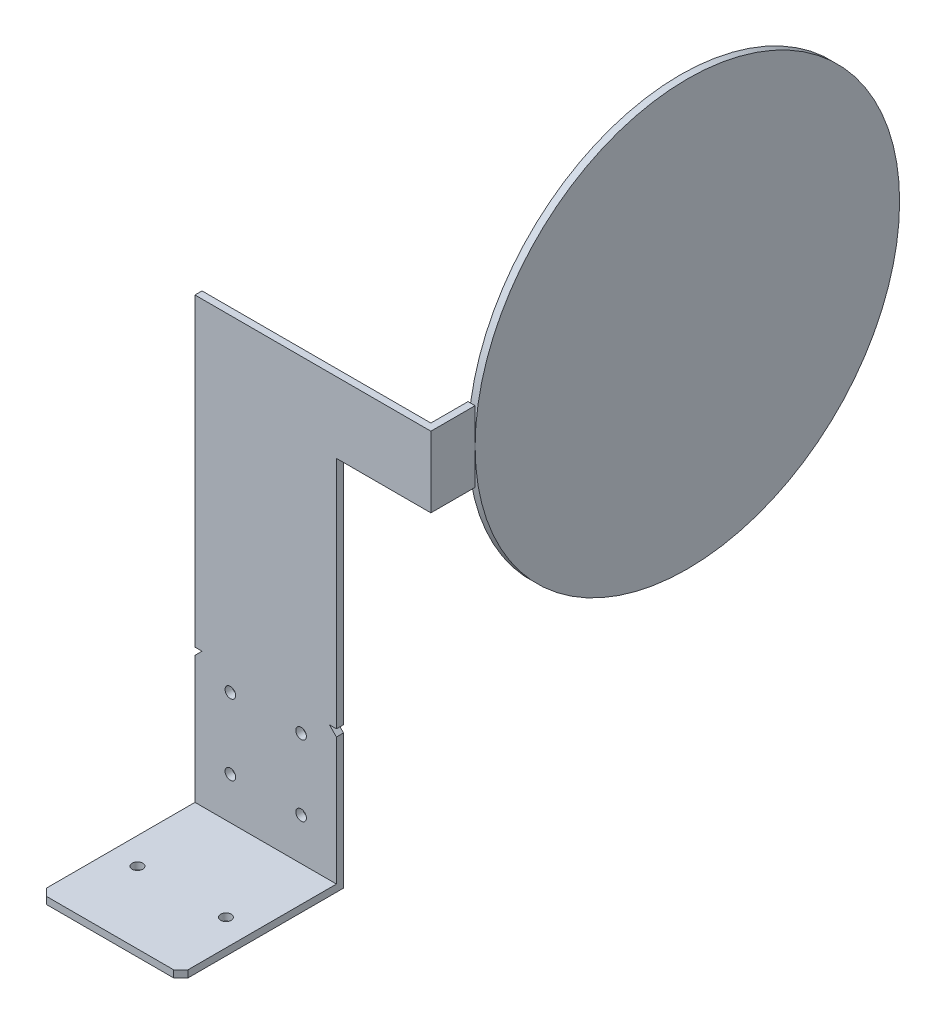
ISO-10303-21;
HEADER;
FILE_DESCRIPTION(('STEP AP214'),'2;1');
FILE_NAME('part.step','',(''),(''),'','','');
FILE_SCHEMA(('AUTOMOTIVE_DESIGN { 1 0 10303 214 1 1 1 1 }'));
ENDSEC;
DATA;
#1=APPLICATION_CONTEXT('core data for automotive mechanical design processes');
#2=APPLICATION_PROTOCOL_DEFINITION('international standard','automotive_design',2000,#1);
#3=PRODUCT_CONTEXT('',#1,'mechanical');
#4=PRODUCT('Part','Part','',(#3));
#5=PRODUCT_RELATED_PRODUCT_CATEGORY('part','',(#4));
#6=PRODUCT_DEFINITION_FORMATION('','',#4);
#7=PRODUCT_DEFINITION_CONTEXT('part definition',#1,'design');
#8=PRODUCT_DEFINITION('design','',#6,#7);
#9=PRODUCT_DEFINITION_SHAPE('','',#8);
#10=(LENGTH_UNIT() NAMED_UNIT(*) SI_UNIT(.MILLI.,.METRE.));
#11=(NAMED_UNIT(*) PLANE_ANGLE_UNIT() SI_UNIT($,.RADIAN.));
#12=(NAMED_UNIT(*) SI_UNIT($,.STERADIAN.) SOLID_ANGLE_UNIT());
#13=UNCERTAINTY_MEASURE_WITH_UNIT(LENGTH_MEASURE(1.E-05),#10,'distance_accuracy_value','');
#14=(GEOMETRIC_REPRESENTATION_CONTEXT(3) GLOBAL_UNCERTAINTY_ASSIGNED_CONTEXT((#13)) GLOBAL_UNIT_ASSIGNED_CONTEXT((#10,
#11,#12)) REPRESENTATION_CONTEXT('',''));
#15=CARTESIAN_POINT('',(0.,0.,0.));
#16=DIRECTION('',(0.,0.,1.));
#17=DIRECTION('',(1.,0.,0.));
#18=AXIS2_PLACEMENT_3D('',#15,#16,#17);
#19=CARTESIAN_POINT('',(64.69,114.21,-72.5));
#20=DIRECTION('',(1.,0.,0.));
#21=DIRECTION('',(0.,0.,-1.));
#22=AXIS2_PLACEMENT_3D('',#19,#20,#21);
#23=CYLINDRICAL_SURFACE('',#22,60.);
#24=CARTESIAN_POINT('',(64.69,114.21,-72.5));
#25=DIRECTION('',(1.,0.,0.));
#26=DIRECTION('',(0.,0.,-1.));
#27=AXIS2_PLACEMENT_3D('',#24,#25,#26);
#28=CIRCLE('',#27,60.);
#29=CARTESIAN_POINT('',(64.69,114.21,-132.5));
#30=VERTEX_POINT('',#29);
#31=EDGE_CURVE('E11',#30,#30,#28,.T.);
#32=ORIENTED_EDGE('',*,*,#31,.T.);
#33=EDGE_LOOP('',(#32));
#34=FACE_BOUND('',#33,.T.);
#35=CARTESIAN_POINT('',(66.69,114.21,-72.5));
#36=DIRECTION('',(1.,0.,0.));
#37=DIRECTION('',(0.,0.,-1.));
#38=AXIS2_PLACEMENT_3D('',#35,#36,#37);
#39=CIRCLE('',#38,60.);
#40=CARTESIAN_POINT('',(66.69,114.21,-132.5));
#41=VERTEX_POINT('',#40);
#42=EDGE_CURVE('E46',#41,#41,#39,.T.);
#43=ORIENTED_EDGE('',*,*,#42,.F.);
#44=EDGE_LOOP('',(#43));
#45=FACE_BOUND('',#44,.T.);
#46=ADVANCED_FACE('F43',(#34,#45),#23,.T.);
#47=CARTESIAN_POINT('',(64.69,114.21,-72.5));
#48=DIRECTION('',(1.,0.,0.));
#49=DIRECTION('',(0.,0.,-1.));
#50=AXIS2_PLACEMENT_3D('',#47,#48,#49);
#51=PLANE('',#50);
#52=ORIENTED_EDGE('',*,*,#31,.F.);
#53=EDGE_LOOP('',(#52));
#54=FACE_BOUND('',#53,.T.);
#55=ADVANCED_FACE('F58',(#54),#51,.F.);
#56=CARTESIAN_POINT('',(66.69,114.21,-72.5));
#57=DIRECTION('',(1.,0.,0.));
#58=DIRECTION('',(0.,0.,-1.));
#59=AXIS2_PLACEMENT_3D('',#56,#57,#58);
#60=PLANE('',#59);
#61=ORIENTED_EDGE('',*,*,#42,.T.);
#62=EDGE_LOOP('',(#61));
#63=FACE_BOUND('',#62,.T.);
#64=ADVANCED_FACE('F55',(#63),#60,.T.);
#65=CLOSED_SHELL('',(#46,#55,#64));
#66=MANIFOLD_SOLID_BREP('B2',#65);
#67=CARTESIAN_POINT('',(40.,0.,44.));
#68=DIRECTION('',(0.,-1.,0.));
#69=DIRECTION('',(0.,0.,-1.));
#70=AXIS2_PLACEMENT_3D('',#67,#68,#69);
#71=PLANE('',#70);
#72=CARTESIAN_POINT('',(7.5,0.,23.75));
#73=DIRECTION('',(0.,-1.,0.));
#74=DIRECTION('',(0.,0.,-1.));
#75=AXIS2_PLACEMENT_3D('',#72,#73,#74);
#76=CIRCLE('',#75,1.49999999997635);
#77=CARTESIAN_POINT('',(7.5,0.,22.2500000000236));
#78=VERTEX_POINT('',#77);
#79=EDGE_CURVE('E305',#78,#78,#76,.F.);
#80=ORIENTED_EDGE('',*,*,#79,.F.);
#81=EDGE_LOOP('',(#80));
#82=FACE_BOUND('',#81,.T.);
#83=CARTESIAN_POINT('',(32.5,0.,23.75));
#84=DIRECTION('',(0.,-1.,0.));
#85=DIRECTION('',(0.,0.,-1.));
#86=AXIS2_PLACEMENT_3D('',#83,#84,#85);
#87=CIRCLE('',#86,1.49999999997635);
#88=CARTESIAN_POINT('',(32.5,0.,22.2500000000236));
#89=VERTEX_POINT('',#88);
#90=EDGE_CURVE('E311',#89,#89,#87,.F.);
#91=ORIENTED_EDGE('',*,*,#90,.F.);
#92=EDGE_LOOP('',(#91));
#93=FACE_BOUND('',#92,.T.);
#94=DIRECTION('',(-1.,0.,0.));
#95=VECTOR('',#94,1.);
#96=CARTESIAN_POINT('',(40.,0.,44.));
#97=LINE('',#96,#95);
#98=CARTESIAN_POINT('',(38.,0.,44.));
#99=VERTEX_POINT('',#98);
#100=CARTESIAN_POINT('',(2.00000000000001,0.,44.));
#101=VERTEX_POINT('',#100);
#102=EDGE_CURVE('E342',#99,#101,#97,.T.);
#103=ORIENTED_EDGE('',*,*,#102,.F.);
#104=DIRECTION('',(0.707106781186549,0.,-0.707106781186546));
#105=VECTOR('',#104,1.);
#106=CARTESIAN_POINT('',(40.,0.,42.));
#107=LINE('',#106,#105);
#108=CARTESIAN_POINT('',(40.,0.,42.));
#109=VERTEX_POINT('',#108);
#110=EDGE_CURVE('E362',#99,#109,#107,.T.);
#111=ORIENTED_EDGE('',*,*,#110,.T.);
#112=DIRECTION('',(0.,0.,1.));
#113=VECTOR('',#112,1.);
#114=CARTESIAN_POINT('',(40.,0.,44.));
#115=LINE('',#114,#113);
#116=CARTESIAN_POINT('',(40.,0.,0.));
#117=VERTEX_POINT('',#116);
#118=EDGE_CURVE('E315',#117,#109,#115,.T.);
#119=ORIENTED_EDGE('',*,*,#118,.F.);
#120=DIRECTION('',(-1.,0.,0.));
#121=VECTOR('',#120,1.);
#122=CARTESIAN_POINT('',(40.,0.,0.));
#123=LINE('',#122,#121);
#124=CARTESIAN_POINT('',(0.,0.,0.));
#125=VERTEX_POINT('',#124);
#126=EDGE_CURVE('E326',#117,#125,#123,.T.);
#127=ORIENTED_EDGE('',*,*,#126,.T.);
#128=DIRECTION('',(0.,0.,1.));
#129=VECTOR('',#128,1.);
#130=CARTESIAN_POINT('',(0.,0.,44.));
#131=LINE('',#130,#129);
#132=CARTESIAN_POINT('',(0.,0.,42.));
#133=VERTEX_POINT('',#132);
#134=EDGE_CURVE('E314',#125,#133,#131,.T.);
#135=ORIENTED_EDGE('',*,*,#134,.T.);
#136=DIRECTION('',(-0.707106781186546,0.,-0.707106781186549));
#137=VECTOR('',#136,1.);
#138=CARTESIAN_POINT('',(2.00000000000001,0.,44.));
#139=LINE('',#138,#137);
#140=EDGE_CURVE('E360',#133,#101,#139,.F.);
#141=ORIENTED_EDGE('',*,*,#140,.T.);
#142=EDGE_LOOP('',(#103,#111,#119,#127,#135,#141));
#143=FACE_BOUND('',#142,.T.);
#144=ADVANCED_FACE('F84',(#82,#93,#143),#71,.F.);
#145=CARTESIAN_POINT('',(40.,-2.00000000000001,44.));
#146=DIRECTION('',(0.,0.,-1.));
#147=DIRECTION('',(-1.,0.,0.));
#148=AXIS2_PLACEMENT_3D('',#145,#146,#147);
#149=PLANE('',#148);
#150=DIRECTION('',(-1.,0.,0.));
#151=VECTOR('',#150,1.);
#152=CARTESIAN_POINT('',(40.,-2.00000000000001,44.));
#153=LINE('',#152,#151);
#154=CARTESIAN_POINT('',(38.,-2.00000000000001,44.));
#155=VERTEX_POINT('',#154);
#156=CARTESIAN_POINT('',(2.00000000000001,-2.00000000000001,44.));
#157=VERTEX_POINT('',#156);
#158=EDGE_CURVE('E339',#155,#157,#153,.T.);
#159=ORIENTED_EDGE('',*,*,#158,.F.);
#160=DIRECTION('',(0.,1.,0.));
#161=VECTOR('',#160,1.);
#162=CARTESIAN_POINT('',(38.,0.,44.));
#163=LINE('',#162,#161);
#164=EDGE_CURVE('E358',#155,#99,#163,.T.);
#165=ORIENTED_EDGE('',*,*,#164,.T.);
#166=ORIENTED_EDGE('',*,*,#102,.T.);
#167=DIRECTION('',(0.,-1.,0.));
#168=VECTOR('',#167,1.);
#169=CARTESIAN_POINT('',(2.00000000000001,-2.00000000000001,44.));
#170=LINE('',#169,#168);
#171=EDGE_CURVE('E355',#101,#157,#170,.T.);
#172=ORIENTED_EDGE('',*,*,#171,.T.);
#173=EDGE_LOOP('',(#159,#165,#166,#172));
#174=FACE_BOUND('',#173,.T.);
#175=ADVANCED_FACE('F404',(#174),#149,.F.);
#176=CARTESIAN_POINT('',(40.,-2.,-2.00000000000001));
#177=DIRECTION('',(0.,1.,0.));
#178=DIRECTION('',(0.,0.,1.));
#179=AXIS2_PLACEMENT_3D('',#176,#177,#178);
#180=PLANE('',#179);
#181=CARTESIAN_POINT('',(7.5,-2.,23.75));
#182=DIRECTION('',(0.,-1.,0.));
#183=DIRECTION('',(0.,0.,-1.));
#184=AXIS2_PLACEMENT_3D('',#181,#182,#183);
#185=CIRCLE('',#184,1.49999999997635);
#186=CARTESIAN_POINT('',(7.5,-2.,22.2500000000236));
#187=VERTEX_POINT('',#186);
#188=EDGE_CURVE('E302',#187,#187,#185,.T.);
#189=ORIENTED_EDGE('',*,*,#188,.F.);
#190=EDGE_LOOP('',(#189));
#191=FACE_BOUND('',#190,.T.);
#192=CARTESIAN_POINT('',(32.5,-2.,23.75));
#193=DIRECTION('',(0.,-1.,0.));
#194=DIRECTION('',(0.,0.,-1.));
#195=AXIS2_PLACEMENT_3D('',#192,#193,#194);
#196=CIRCLE('',#195,1.49999999997635);
#197=CARTESIAN_POINT('',(32.5,-2.,22.2500000000236));
#198=VERTEX_POINT('',#197);
#199=EDGE_CURVE('E308',#198,#198,#196,.T.);
#200=ORIENTED_EDGE('',*,*,#199,.F.);
#201=EDGE_LOOP('',(#200));
#202=FACE_BOUND('',#201,.T.);
#203=DIRECTION('',(0.,0.,-1.));
#204=VECTOR('',#203,1.);
#205=CARTESIAN_POINT('',(40.,-2.,-2.00000000000001));
#206=LINE('',#205,#204);
#207=CARTESIAN_POINT('',(40.,-2.00000000000001,42.));
#208=VERTEX_POINT('',#207);
#209=CARTESIAN_POINT('',(40.,-2.,-2.00000000000001));
#210=VERTEX_POINT('',#209);
#211=EDGE_CURVE('E318',#208,#210,#206,.T.);
#212=ORIENTED_EDGE('',*,*,#211,.F.);
#213=DIRECTION('',(-0.707106781186549,0.,0.707106781186546));
#214=VECTOR('',#213,1.);
#215=CARTESIAN_POINT('',(40.,-2.00000000000001,42.));
#216=LINE('',#215,#214);
#217=EDGE_CURVE('E353',#208,#155,#216,.T.);
#218=ORIENTED_EDGE('',*,*,#217,.T.);
#219=ORIENTED_EDGE('',*,*,#158,.T.);
#220=DIRECTION('',(0.707106781186546,0.,0.707106781186549));
#221=VECTOR('',#220,1.);
#222=CARTESIAN_POINT('',(2.00000000000001,-2.00000000000001,44.));
#223=LINE('',#222,#221);
#224=CARTESIAN_POINT('',(0.,-2.00000000000001,42.));
#225=VERTEX_POINT('',#224);
#226=EDGE_CURVE('E351',#157,#225,#223,.F.);
#227=ORIENTED_EDGE('',*,*,#226,.T.);
#228=DIRECTION('',(0.,0.,-1.));
#229=VECTOR('',#228,1.);
#230=CARTESIAN_POINT('',(0.,-2.,-2.00000000000001));
#231=LINE('',#230,#229);
#232=CARTESIAN_POINT('',(0.,-2.,-2.00000000000001));
#233=VERTEX_POINT('',#232);
#234=EDGE_CURVE('E329',#225,#233,#231,.T.);
#235=ORIENTED_EDGE('',*,*,#234,.T.);
#236=DIRECTION('',(-1.,0.,0.));
#237=VECTOR('',#236,1.);
#238=CARTESIAN_POINT('',(40.,-2.,-2.00000000000001));
#239=LINE('',#238,#237);
#240=EDGE_CURVE('E336',#210,#233,#239,.T.);
#241=ORIENTED_EDGE('',*,*,#240,.F.);
#242=EDGE_LOOP('',(#212,#218,#219,#227,#235,#241));
#243=FACE_BOUND('',#242,.T.);
#244=ADVANCED_FACE('F402',(#191,#202,#243),#180,.F.);
#245=CARTESIAN_POINT('',(40.,38.,-2.));
#246=DIRECTION('',(0.,0.,1.));
#247=DIRECTION('',(0.,-1.,0.));
#248=AXIS2_PLACEMENT_3D('',#245,#246,#247);
#249=PLANE('',#248);
#250=CARTESIAN_POINT('',(9.99999999999981,11.9,-2.));
#251=DIRECTION('',(0.,0.,-1.));
#252=DIRECTION('',(0.,1.,0.));
#253=AXIS2_PLACEMENT_3D('',#250,#251,#252);
#254=CIRCLE('',#253,1.5);
#255=CARTESIAN_POINT('',(9.99999999999981,13.4,-2.));
#256=VERTEX_POINT('',#255);
#257=EDGE_CURVE('E274',#256,#256,#254,.T.);
#258=ORIENTED_EDGE('',*,*,#257,.F.);
#259=EDGE_LOOP('',(#258));
#260=FACE_BOUND('',#259,.T.);
#261=CARTESIAN_POINT('',(29.9999999999998,11.8999999999999,-2.));
#262=DIRECTION('',(0.,0.,-1.));
#263=DIRECTION('',(0.,1.,0.));
#264=AXIS2_PLACEMENT_3D('',#261,#262,#263);
#265=CIRCLE('',#264,1.5);
#266=CARTESIAN_POINT('',(29.9999999999998,13.3999999999999,-2.));
#267=VERTEX_POINT('',#266);
#268=EDGE_CURVE('E284',#267,#267,#265,.T.);
#269=ORIENTED_EDGE('',*,*,#268,.F.);
#270=EDGE_LOOP('',(#269));
#271=FACE_BOUND('',#270,.T.);
#272=CARTESIAN_POINT('',(30.,31.8999999999999,-2.));
#273=DIRECTION('',(0.,0.,-1.));
#274=DIRECTION('',(0.,1.,0.));
#275=AXIS2_PLACEMENT_3D('',#272,#273,#274);
#276=CIRCLE('',#275,1.5);
#277=CARTESIAN_POINT('',(30.,33.3999999999999,-2.));
#278=VERTEX_POINT('',#277);
#279=EDGE_CURVE('E290',#278,#278,#276,.T.);
#280=ORIENTED_EDGE('',*,*,#279,.F.);
#281=EDGE_LOOP('',(#280));
#282=FACE_BOUND('',#281,.T.);
#283=CARTESIAN_POINT('',(10.,31.9,-2.));
#284=DIRECTION('',(0.,0.,-1.));
#285=DIRECTION('',(0.,1.,0.));
#286=AXIS2_PLACEMENT_3D('',#283,#284,#285);
#287=CIRCLE('',#286,1.5);
#288=CARTESIAN_POINT('',(10.,33.4,-2.));
#289=VERTEX_POINT('',#288);
#290=EDGE_CURVE('E296',#289,#289,#287,.T.);
#291=ORIENTED_EDGE('',*,*,#290,.F.);
#292=EDGE_LOOP('',(#291));
#293=FACE_BOUND('',#292,.T.);
#294=DIRECTION('',(1.,0.,0.));
#295=VECTOR('',#294,1.);
#296=CARTESIAN_POINT('',(0.,124.21,-1.99999999999999));
#297=LINE('',#296,#295);
#298=CARTESIAN_POINT('',(0.,124.21,-1.99999999999999));
#299=VERTEX_POINT('',#298);
#300=CARTESIAN_POINT('',(64.69,124.21,-1.99999999999999));
#301=VERTEX_POINT('',#300);
#302=EDGE_CURVE('E263',#299,#301,#297,.T.);
#303=ORIENTED_EDGE('',*,*,#302,.T.);
#304=DIRECTION('',(0.,-1.,0.));
#305=VECTOR('',#304,1.);
#306=CARTESIAN_POINT('',(64.69,124.21,-1.99999999999999));
#307=LINE('',#306,#305);
#308=CARTESIAN_POINT('',(64.69,104.21,-1.99999999999999));
#309=VERTEX_POINT('',#308);
#310=EDGE_CURVE('E228',#301,#309,#307,.T.);
#311=ORIENTED_EDGE('',*,*,#310,.T.);
#312=DIRECTION('',(-1.,0.,0.));
#313=VECTOR('',#312,1.);
#314=CARTESIAN_POINT('',(40.,104.21,-1.99999999999999));
#315=LINE('',#314,#313);
#316=CARTESIAN_POINT('',(40.,104.21,-1.99999999999999));
#317=VERTEX_POINT('',#316);
#318=EDGE_CURVE('E227',#309,#317,#315,.T.);
#319=ORIENTED_EDGE('',*,*,#318,.T.);
#320=DIRECTION('',(0.,-1.,0.));
#321=VECTOR('',#320,1.);
#322=CARTESIAN_POINT('',(40.,38.,-2.));
#323=LINE('',#322,#321);
#324=CARTESIAN_POINT('',(40.,38.,-2.));
#325=VERTEX_POINT('',#324);
#326=EDGE_CURVE('E266',#317,#325,#323,.T.);
#327=ORIENTED_EDGE('',*,*,#326,.T.);
#328=DIRECTION('',(-1.,0.,0.));
#329=VECTOR('',#328,1.);
#330=CARTESIAN_POINT('',(0.,38.,-2.));
#331=LINE('',#330,#329);
#332=CARTESIAN_POINT('',(38.,38.,-2.));
#333=VERTEX_POINT('',#332);
#334=EDGE_CURVE('E252',#325,#333,#331,.T.);
#335=ORIENTED_EDGE('',*,*,#334,.T.);
#336=DIRECTION('',(0.707106781186548,-0.707106781186548,0.));
#337=VECTOR('',#336,1.);
#338=CARTESIAN_POINT('',(40.,36.,-2.));
#339=LINE('',#338,#337);
#340=CARTESIAN_POINT('',(40.,36.,-2.));
#341=VERTEX_POINT('',#340);
#342=EDGE_CURVE('E92',#333,#341,#339,.T.);
#343=ORIENTED_EDGE('',*,*,#342,.T.);
#344=DIRECTION('',(0.,1.,0.));
#345=VECTOR('',#344,1.);
#346=CARTESIAN_POINT('',(40.,38.,-2.));
#347=LINE('',#346,#345);
#348=EDGE_CURVE('E321',#210,#341,#347,.T.);
#349=ORIENTED_EDGE('',*,*,#348,.F.);
#350=ORIENTED_EDGE('',*,*,#240,.T.);
#351=DIRECTION('',(0.,1.,0.));
#352=VECTOR('',#351,1.);
#353=CARTESIAN_POINT('',(0.,38.,-2.));
#354=LINE('',#353,#352);
#355=CARTESIAN_POINT('',(0.,36.,-2.));
#356=VERTEX_POINT('',#355);
#357=EDGE_CURVE('E331',#233,#356,#354,.T.);
#358=ORIENTED_EDGE('',*,*,#357,.T.);
#359=DIRECTION('',(-0.707106781186546,-0.707106781186549,0.));
#360=VECTOR('',#359,1.);
#361=CARTESIAN_POINT('',(2.00000000000001,38.,-2.));
#362=LINE('',#361,#360);
#363=CARTESIAN_POINT('',(2.00000000000001,38.,-2.));
#364=VERTEX_POINT('',#363);
#365=EDGE_CURVE('E41',#356,#364,#362,.F.);
#366=ORIENTED_EDGE('',*,*,#365,.T.);
#367=CARTESIAN_POINT('',(0.,38.,-2.));
#368=VERTEX_POINT('',#367);
#369=EDGE_CURVE('E268',#364,#368,#331,.T.);
#370=ORIENTED_EDGE('',*,*,#369,.T.);
#371=DIRECTION('',(0.,1.,0.));
#372=VECTOR('',#371,1.);
#373=CARTESIAN_POINT('',(0.,38.,-2.));
#374=LINE('',#373,#372);
#375=EDGE_CURVE('E244',#368,#299,#374,.T.);
#376=ORIENTED_EDGE('',*,*,#375,.T.);
#377=EDGE_LOOP('',(#303,#311,#319,#327,#335,#343,#349,#350,#358,#366,#370,#376));
#378=FACE_BOUND('',#377,.T.);
#379=ADVANCED_FACE('F378',(#260,#271,#282,#293,#378),#249,.F.);
#380=CARTESIAN_POINT('',(40.,0.,0.));
#381=DIRECTION('',(0.,0.,-1.));
#382=DIRECTION('',(-1.,0.,0.));
#383=AXIS2_PLACEMENT_3D('',#380,#381,#382);
#384=PLANE('',#383);
#385=CARTESIAN_POINT('',(9.99999999999981,11.9,0.));
#386=DIRECTION('',(0.,0.,-1.));
#387=DIRECTION('',(-1.,0.,0.));
#388=AXIS2_PLACEMENT_3D('',#385,#386,#387);
#389=CIRCLE('',#388,1.5);
#390=CARTESIAN_POINT('',(8.4999999999998,11.9,0.));
#391=VERTEX_POINT('',#390);
#392=EDGE_CURVE('E281',#391,#391,#389,.F.);
#393=ORIENTED_EDGE('',*,*,#392,.F.);
#394=EDGE_LOOP('',(#393));
#395=FACE_BOUND('',#394,.T.);
#396=CARTESIAN_POINT('',(29.9999999999998,11.8999999999999,0.));
#397=DIRECTION('',(0.,0.,-1.));
#398=DIRECTION('',(-1.,0.,0.));
#399=AXIS2_PLACEMENT_3D('',#396,#397,#398);
#400=CIRCLE('',#399,1.5);
#401=CARTESIAN_POINT('',(28.4999999999998,11.8999999999999,0.));
#402=VERTEX_POINT('',#401);
#403=EDGE_CURVE('E287',#402,#402,#400,.F.);
#404=ORIENTED_EDGE('',*,*,#403,.F.);
#405=EDGE_LOOP('',(#404));
#406=FACE_BOUND('',#405,.T.);
#407=CARTESIAN_POINT('',(30.,31.8999999999999,0.));
#408=DIRECTION('',(0.,0.,-1.));
#409=DIRECTION('',(-1.,0.,0.));
#410=AXIS2_PLACEMENT_3D('',#407,#408,#409);
#411=CIRCLE('',#410,1.5);
#412=CARTESIAN_POINT('',(28.5,31.8999999999999,0.));
#413=VERTEX_POINT('',#412);
#414=EDGE_CURVE('E293',#413,#413,#411,.F.);
#415=ORIENTED_EDGE('',*,*,#414,.F.);
#416=EDGE_LOOP('',(#415));
#417=FACE_BOUND('',#416,.T.);
#418=CARTESIAN_POINT('',(10.,31.9,0.));
#419=DIRECTION('',(0.,0.,-1.));
#420=DIRECTION('',(-1.,0.,0.));
#421=AXIS2_PLACEMENT_3D('',#418,#419,#420);
#422=CIRCLE('',#421,1.5);
#423=CARTESIAN_POINT('',(8.50000000000001,31.9,0.));
#424=VERTEX_POINT('',#423);
#425=EDGE_CURVE('E299',#424,#424,#422,.F.);
#426=ORIENTED_EDGE('',*,*,#425,.F.);
#427=EDGE_LOOP('',(#426));
#428=FACE_BOUND('',#427,.T.);
#429=DIRECTION('',(-0.707106781186548,0.707106781186548,0.));
#430=VECTOR('',#429,1.);
#431=CARTESIAN_POINT('',(40.,36.,0.));
#432=LINE('',#431,#430);
#433=CARTESIAN_POINT('',(40.,36.,0.));
#434=VERTEX_POINT('',#433);
#435=CARTESIAN_POINT('',(38.,38.,0.));
#436=VERTEX_POINT('',#435);
#437=EDGE_CURVE('E374',#434,#436,#432,.T.);
#438=ORIENTED_EDGE('',*,*,#437,.T.);
#439=DIRECTION('',(-1.,0.,0.));
#440=VECTOR('',#439,1.);
#441=CARTESIAN_POINT('',(0.,38.,0.));
#442=LINE('',#441,#440);
#443=CARTESIAN_POINT('',(40.,38.,0.));
#444=VERTEX_POINT('',#443);
#445=EDGE_CURVE('E257',#444,#436,#442,.T.);
#446=ORIENTED_EDGE('',*,*,#445,.F.);
#447=DIRECTION('',(0.,-1.,0.));
#448=VECTOR('',#447,1.);
#449=CARTESIAN_POINT('',(40.,38.,0.));
#450=LINE('',#449,#448);
#451=CARTESIAN_POINT('',(40.,104.21,0.));
#452=VERTEX_POINT('',#451);
#453=EDGE_CURVE('E254',#452,#444,#450,.T.);
#454=ORIENTED_EDGE('',*,*,#453,.F.);
#455=DIRECTION('',(-1.,0.,0.));
#456=VECTOR('',#455,1.);
#457=CARTESIAN_POINT('',(40.,104.21,0.));
#458=LINE('',#457,#456);
#459=CARTESIAN_POINT('',(66.69,104.21,0.));
#460=VERTEX_POINT('',#459);
#461=EDGE_CURVE('E238',#460,#452,#458,.T.);
#462=ORIENTED_EDGE('',*,*,#461,.F.);
#463=DIRECTION('',(0.,-1.,0.));
#464=VECTOR('',#463,1.);
#465=CARTESIAN_POINT('',(66.69,124.21,0.));
#466=LINE('',#465,#464);
#467=CARTESIAN_POINT('',(66.69,124.21,0.));
#468=VERTEX_POINT('',#467);
#469=EDGE_CURVE('E235',#468,#460,#466,.T.);
#470=ORIENTED_EDGE('',*,*,#469,.F.);
#471=DIRECTION('',(1.,0.,0.));
#472=VECTOR('',#471,1.);
#473=CARTESIAN_POINT('',(0.,124.21,0.));
#474=LINE('',#473,#472);
#475=CARTESIAN_POINT('',(0.,124.21,0.));
#476=VERTEX_POINT('',#475);
#477=EDGE_CURVE('E251',#476,#468,#474,.T.);
#478=ORIENTED_EDGE('',*,*,#477,.F.);
#479=DIRECTION('',(0.,1.,0.));
#480=VECTOR('',#479,1.);
#481=CARTESIAN_POINT('',(0.,38.,0.));
#482=LINE('',#481,#480);
#483=CARTESIAN_POINT('',(0.,38.,0.));
#484=VERTEX_POINT('',#483);
#485=EDGE_CURVE('E248',#484,#476,#482,.T.);
#486=ORIENTED_EDGE('',*,*,#485,.F.);
#487=CARTESIAN_POINT('',(2.00000000000001,38.,0.));
#488=VERTEX_POINT('',#487);
#489=EDGE_CURVE('E256',#488,#484,#442,.T.);
#490=ORIENTED_EDGE('',*,*,#489,.F.);
#491=DIRECTION('',(0.707106781186546,0.707106781186549,0.));
#492=VECTOR('',#491,1.);
#493=CARTESIAN_POINT('',(2.00000000000001,38.,0.));
#494=LINE('',#493,#492);
#495=CARTESIAN_POINT('',(0.,36.,0.));
#496=VERTEX_POINT('',#495);
#497=EDGE_CURVE('E376',#488,#496,#494,.F.);
#498=ORIENTED_EDGE('',*,*,#497,.T.);
#499=DIRECTION('',(0.,-1.,0.));
#500=VECTOR('',#499,1.);
#501=CARTESIAN_POINT('',(0.,0.,0.));
#502=LINE('',#501,#500);
#503=EDGE_CURVE('E319',#496,#125,#502,.T.);
#504=ORIENTED_EDGE('',*,*,#503,.T.);
#505=ORIENTED_EDGE('',*,*,#126,.F.);
#506=DIRECTION('',(0.,-1.,0.));
#507=VECTOR('',#506,1.);
#508=CARTESIAN_POINT('',(40.,0.,0.));
#509=LINE('',#508,#507);
#510=EDGE_CURVE('E324',#434,#117,#509,.T.);
#511=ORIENTED_EDGE('',*,*,#510,.F.);
#512=EDGE_LOOP('',(#438,#446,#454,#462,#470,#478,#486,#490,#498,#504,#505,#511));
#513=FACE_BOUND('',#512,.T.);
#514=ADVANCED_FACE('F390',(#395,#406,#417,#428,#513),#384,.F.);
#515=CARTESIAN_POINT('',(40.,0.,0.));
#516=DIRECTION('',(1.,0.,0.));
#517=DIRECTION('',(0.,0.,-1.));
#518=AXIS2_PLACEMENT_3D('',#515,#516,#517);
#519=PLANE('',#518);
#520=ORIENTED_EDGE('',*,*,#118,.T.);
#521=DIRECTION('',(0.,-1.,0.));
#522=VECTOR('',#521,1.);
#523=CARTESIAN_POINT('',(40.,-2.00000000000001,42.));
#524=LINE('',#523,#522);
#525=EDGE_CURVE('E348',#109,#208,#524,.T.);
#526=ORIENTED_EDGE('',*,*,#525,.T.);
#527=ORIENTED_EDGE('',*,*,#211,.T.);
#528=ORIENTED_EDGE('',*,*,#348,.T.);
#529=DIRECTION('',(0.,0.,1.));
#530=VECTOR('',#529,1.);
#531=CARTESIAN_POINT('',(40.,36.,0.));
#532=LINE('',#531,#530);
#533=EDGE_CURVE('E345',#341,#434,#532,.T.);
#534=ORIENTED_EDGE('',*,*,#533,.T.);
#535=ORIENTED_EDGE('',*,*,#510,.T.);
#536=EDGE_LOOP('',(#520,#526,#527,#528,#534,#535));
#537=FACE_BOUND('',#536,.T.);
#538=ADVANCED_FACE('F384',(#537),#519,.T.);
#539=CARTESIAN_POINT('',(0.,0.,0.));
#540=DIRECTION('',(1.,0.,0.));
#541=DIRECTION('',(0.,0.,-1.));
#542=AXIS2_PLACEMENT_3D('',#539,#540,#541);
#543=PLANE('',#542);
#544=ORIENTED_EDGE('',*,*,#234,.F.);
#545=DIRECTION('',(0.,1.,0.));
#546=VECTOR('',#545,1.);
#547=CARTESIAN_POINT('',(0.,0.,42.));
#548=LINE('',#547,#546);
#549=EDGE_CURVE('E366',#225,#133,#548,.T.);
#550=ORIENTED_EDGE('',*,*,#549,.T.);
#551=ORIENTED_EDGE('',*,*,#134,.F.);
#552=ORIENTED_EDGE('',*,*,#503,.F.);
#553=DIRECTION('',(0.,0.,-1.));
#554=VECTOR('',#553,1.);
#555=CARTESIAN_POINT('',(0.,36.,0.));
#556=LINE('',#555,#554);
#557=EDGE_CURVE('E364',#496,#356,#556,.T.);
#558=ORIENTED_EDGE('',*,*,#557,.T.);
#559=ORIENTED_EDGE('',*,*,#357,.F.);
#560=EDGE_LOOP('',(#544,#550,#551,#552,#558,#559));
#561=FACE_BOUND('',#560,.T.);
#562=ADVANCED_FACE('F414',(#561),#543,.F.);
#563=CARTESIAN_POINT('',(32.5,38.001,23.75));
#564=DIRECTION('',(0.,-1.,0.));
#565=DIRECTION('',(0.,0.,-1.));
#566=AXIS2_PLACEMENT_3D('',#563,#564,#565);
#567=CYLINDRICAL_SURFACE('',#566,1.49999999997635);
#568=ORIENTED_EDGE('',*,*,#199,.T.);
#569=EDGE_LOOP('',(#568));
#570=FACE_BOUND('',#569,.T.);
#571=ORIENTED_EDGE('',*,*,#90,.T.);
#572=EDGE_LOOP('',(#571));
#573=FACE_BOUND('',#572,.T.);
#574=ADVANCED_FACE('F590',(#570,#573),#567,.F.);
#575=CARTESIAN_POINT('',(7.5,38.001,23.75));
#576=DIRECTION('',(0.,-1.,0.));
#577=DIRECTION('',(0.,0.,-1.));
#578=AXIS2_PLACEMENT_3D('',#575,#576,#577);
#579=CYLINDRICAL_SURFACE('',#578,1.49999999997635);
#580=ORIENTED_EDGE('',*,*,#188,.T.);
#581=EDGE_LOOP('',(#580));
#582=FACE_BOUND('',#581,.T.);
#583=ORIENTED_EDGE('',*,*,#79,.T.);
#584=EDGE_LOOP('',(#583));
#585=FACE_BOUND('',#584,.T.);
#586=ADVANCED_FACE('F586',(#582,#585),#579,.F.);
#587=CARTESIAN_POINT('',(10.,31.9,44.001));
#588=DIRECTION('',(0.,0.,-1.));
#589=DIRECTION('',(0.,1.,0.));
#590=AXIS2_PLACEMENT_3D('',#587,#588,#589);
#591=CYLINDRICAL_SURFACE('',#590,1.5);
#592=ORIENTED_EDGE('',*,*,#290,.T.);
#593=EDGE_LOOP('',(#592));
#594=FACE_BOUND('',#593,.T.);
#595=ORIENTED_EDGE('',*,*,#425,.T.);
#596=EDGE_LOOP('',(#595));
#597=FACE_BOUND('',#596,.T.);
#598=ADVANCED_FACE('F582',(#594,#597),#591,.F.);
#599=CARTESIAN_POINT('',(30.,31.8999999999999,44.001));
#600=DIRECTION('',(0.,0.,-1.));
#601=DIRECTION('',(0.,1.,0.));
#602=AXIS2_PLACEMENT_3D('',#599,#600,#601);
#603=CYLINDRICAL_SURFACE('',#602,1.5);
#604=ORIENTED_EDGE('',*,*,#279,.T.);
#605=EDGE_LOOP('',(#604));
#606=FACE_BOUND('',#605,.T.);
#607=ORIENTED_EDGE('',*,*,#414,.T.);
#608=EDGE_LOOP('',(#607));
#609=FACE_BOUND('',#608,.T.);
#610=ADVANCED_FACE('F578',(#606,#609),#603,.F.);
#611=CARTESIAN_POINT('',(29.9999999999998,11.8999999999999,44.001));
#612=DIRECTION('',(0.,0.,-1.));
#613=DIRECTION('',(0.,1.,0.));
#614=AXIS2_PLACEMENT_3D('',#611,#612,#613);
#615=CYLINDRICAL_SURFACE('',#614,1.5);
#616=ORIENTED_EDGE('',*,*,#268,.T.);
#617=EDGE_LOOP('',(#616));
#618=FACE_BOUND('',#617,.T.);
#619=ORIENTED_EDGE('',*,*,#403,.T.);
#620=EDGE_LOOP('',(#619));
#621=FACE_BOUND('',#620,.T.);
#622=ADVANCED_FACE('F574',(#618,#621),#615,.F.);
#623=CARTESIAN_POINT('',(9.99999999999981,11.9,44.001));
#624=DIRECTION('',(0.,0.,-1.));
#625=DIRECTION('',(0.,1.,0.));
#626=AXIS2_PLACEMENT_3D('',#623,#624,#625);
#627=CYLINDRICAL_SURFACE('',#626,1.5);
#628=ORIENTED_EDGE('',*,*,#257,.T.);
#629=EDGE_LOOP('',(#628));
#630=FACE_BOUND('',#629,.T.);
#631=ORIENTED_EDGE('',*,*,#392,.T.);
#632=EDGE_LOOP('',(#631));
#633=FACE_BOUND('',#632,.T.);
#634=ADVANCED_FACE('F468',(#630,#633),#627,.F.);
#635=CARTESIAN_POINT('',(40.,0.,42.));
#636=DIRECTION('',(0.707106781186546,0.,0.707106781186549));
#637=DIRECTION('',(0.,1.,0.));
#638=AXIS2_PLACEMENT_3D('',#635,#636,#637);
#639=PLANE('',#638);
#640=ORIENTED_EDGE('',*,*,#110,.F.);
#641=ORIENTED_EDGE('',*,*,#164,.F.);
#642=ORIENTED_EDGE('',*,*,#217,.F.);
#643=ORIENTED_EDGE('',*,*,#525,.F.);
#644=EDGE_LOOP('',(#640,#641,#642,#643));
#645=FACE_BOUND('',#644,.T.);
#646=ADVANCED_FACE('F398',(#645),#639,.T.);
#647=CARTESIAN_POINT('',(2.00000000000001,-2.00000000000001,44.));
#648=DIRECTION('',(0.707106781186549,0.,-0.707106781186546));
#649=DIRECTION('',(0.,-1.,0.));
#650=AXIS2_PLACEMENT_3D('',#647,#648,#649);
#651=PLANE('',#650);
#652=ORIENTED_EDGE('',*,*,#140,.F.);
#653=ORIENTED_EDGE('',*,*,#549,.F.);
#654=ORIENTED_EDGE('',*,*,#226,.F.);
#655=ORIENTED_EDGE('',*,*,#171,.F.);
#656=EDGE_LOOP('',(#652,#653,#654,#655));
#657=FACE_BOUND('',#656,.T.);
#658=ADVANCED_FACE('F409',(#657),#651,.F.);
#659=CARTESIAN_POINT('',(2.00000000000001,38.,0.));
#660=DIRECTION('',(0.707106781186549,-0.707106781186546,0.));
#661=DIRECTION('',(0.,0.,1.));
#662=AXIS2_PLACEMENT_3D('',#659,#660,#661);
#663=PLANE('',#662);
#664=ORIENTED_EDGE('',*,*,#365,.F.);
#665=ORIENTED_EDGE('',*,*,#557,.F.);
#666=ORIENTED_EDGE('',*,*,#497,.F.);
#667=DIRECTION('',(0.,0.,1.));
#668=VECTOR('',#667,1.);
#669=CARTESIAN_POINT('',(2.00000000000001,38.,0.));
#670=LINE('',#669,#668);
#671=EDGE_CURVE('E371',#364,#488,#670,.T.);
#672=ORIENTED_EDGE('',*,*,#671,.F.);
#673=EDGE_LOOP('',(#664,#665,#666,#672));
#674=FACE_BOUND('',#673,.T.);
#675=ADVANCED_FACE('F419',(#674),#663,.F.);
#676=CARTESIAN_POINT('',(40.,36.,0.));
#677=DIRECTION('',(0.707106781186547,0.707106781186547,0.));
#678=DIRECTION('',(0.,0.,-1.));
#679=AXIS2_PLACEMENT_3D('',#676,#677,#678);
#680=PLANE('',#679);
#681=ORIENTED_EDGE('',*,*,#342,.F.);
#682=DIRECTION('',(0.,0.,-1.));
#683=VECTOR('',#682,1.);
#684=CARTESIAN_POINT('',(38.,38.,-2.));
#685=LINE('',#684,#683);
#686=EDGE_CURVE('E368',#436,#333,#685,.T.);
#687=ORIENTED_EDGE('',*,*,#686,.F.);
#688=ORIENTED_EDGE('',*,*,#437,.F.);
#689=ORIENTED_EDGE('',*,*,#533,.F.);
#690=EDGE_LOOP('',(#681,#687,#688,#689));
#691=FACE_BOUND('',#690,.T.);
#692=ADVANCED_FACE('F86',(#691),#680,.T.);
#693=CARTESIAN_POINT('',(0.,38.,0.));
#694=DIRECTION('',(0.,-1.,0.));
#695=DIRECTION('',(1.,0.,0.));
#696=AXIS2_PLACEMENT_3D('',#693,#694,#695);
#697=PLANE('',#696);
#698=ORIENTED_EDGE('',*,*,#369,.F.);
#699=ORIENTED_EDGE('',*,*,#671,.T.);
#700=ORIENTED_EDGE('',*,*,#489,.T.);
#701=DIRECTION('',(0.,0.,-1.));
#702=VECTOR('',#701,1.);
#703=CARTESIAN_POINT('',(0.,38.,0.));
#704=LINE('',#703,#702);
#705=EDGE_CURVE('E271',#484,#368,#704,.T.);
#706=ORIENTED_EDGE('',*,*,#705,.T.);
#707=EDGE_LOOP('',(#698,#699,#700,#706));
#708=FACE_BOUND('',#707,.T.);
#709=ADVANCED_FACE('F423',(#708),#697,.T.);
#710=CARTESIAN_POINT('',(0.,38.,0.));
#711=DIRECTION('',(-1.,0.,0.));
#712=DIRECTION('',(0.,0.,1.));
#713=AXIS2_PLACEMENT_3D('',#710,#711,#712);
#714=PLANE('',#713);
#715=ORIENTED_EDGE('',*,*,#375,.F.);
#716=ORIENTED_EDGE('',*,*,#705,.F.);
#717=ORIENTED_EDGE('',*,*,#485,.T.);
#718=DIRECTION('',(0.,0.,-1.));
#719=VECTOR('',#718,1.);
#720=CARTESIAN_POINT('',(0.,124.21,0.));
#721=LINE('',#720,#719);
#722=EDGE_CURVE('E260',#476,#299,#721,.T.);
#723=ORIENTED_EDGE('',*,*,#722,.T.);
#724=EDGE_LOOP('',(#715,#716,#717,#723));
#725=FACE_BOUND('',#724,.T.);
#726=ADVANCED_FACE('F428',(#725),#714,.T.);
#727=ORIENTED_EDGE('',*,*,#445,.T.);
#728=ORIENTED_EDGE('',*,*,#686,.T.);
#729=ORIENTED_EDGE('',*,*,#334,.F.);
#730=DIRECTION('',(0.,0.,-1.));
#731=VECTOR('',#730,1.);
#732=CARTESIAN_POINT('',(40.,38.,0.));
#733=LINE('',#732,#731);
#734=EDGE_CURVE('E275',#444,#325,#733,.T.);
#735=ORIENTED_EDGE('',*,*,#734,.F.);
#736=EDGE_LOOP('',(#727,#728,#729,#735));
#737=FACE_BOUND('',#736,.T.);
#738=ADVANCED_FACE('F444',(#737),#697,.T.);
#739=CARTESIAN_POINT('',(40.,38.,0.));
#740=DIRECTION('',(1.,0.,0.));
#741=DIRECTION('',(0.,0.,-1.));
#742=AXIS2_PLACEMENT_3D('',#739,#740,#741);
#743=PLANE('',#742);
#744=DIRECTION('',(0.,0.,-1.));
#745=VECTOR('',#744,1.);
#746=CARTESIAN_POINT('',(40.,104.21,0.));
#747=LINE('',#746,#745);
#748=EDGE_CURVE('E242',#452,#317,#747,.T.);
#749=ORIENTED_EDGE('',*,*,#748,.F.);
#750=ORIENTED_EDGE('',*,*,#453,.T.);
#751=ORIENTED_EDGE('',*,*,#734,.T.);
#752=ORIENTED_EDGE('',*,*,#326,.F.);
#753=EDGE_LOOP('',(#749,#750,#751,#752));
#754=FACE_BOUND('',#753,.T.);
#755=ADVANCED_FACE('F441',(#754),#743,.T.);
#756=CARTESIAN_POINT('',(0.,124.21,0.));
#757=DIRECTION('',(0.,1.,0.));
#758=DIRECTION('',(0.,0.,1.));
#759=AXIS2_PLACEMENT_3D('',#756,#757,#758);
#760=PLANE('',#759);
#761=ORIENTED_EDGE('',*,*,#302,.F.);
#762=ORIENTED_EDGE('',*,*,#722,.F.);
#763=ORIENTED_EDGE('',*,*,#477,.T.);
#764=DIRECTION('',(0.,0.,-1.));
#765=VECTOR('',#764,1.);
#766=CARTESIAN_POINT('',(66.69,124.21,0.));
#767=LINE('',#766,#765);
#768=CARTESIAN_POINT('',(66.69,124.21,-12.5));
#769=VERTEX_POINT('',#768);
#770=EDGE_CURVE('E240',#468,#769,#767,.T.);
#771=ORIENTED_EDGE('',*,*,#770,.T.);
#772=DIRECTION('',(1.,0.,0.));
#773=VECTOR('',#772,1.);
#774=CARTESIAN_POINT('',(64.69,124.21,-12.5));
#775=LINE('',#774,#773);
#776=CARTESIAN_POINT('',(64.69,124.21,-12.5));
#777=VERTEX_POINT('',#776);
#778=EDGE_CURVE('E218',#777,#769,#775,.T.);
#779=ORIENTED_EDGE('',*,*,#778,.F.);
#780=DIRECTION('',(0.,0.,1.));
#781=VECTOR('',#780,1.);
#782=CARTESIAN_POINT('',(64.69,124.21,-1.99999999999999));
#783=LINE('',#782,#781);
#784=EDGE_CURVE('E219',#777,#301,#783,.T.);
#785=ORIENTED_EDGE('',*,*,#784,.T.);
#786=EDGE_LOOP('',(#761,#762,#763,#771,#779,#785));
#787=FACE_BOUND('',#786,.T.);
#788=ADVANCED_FACE('F432',(#787),#760,.T.);
#789=CARTESIAN_POINT('',(40.,104.21,0.));
#790=DIRECTION('',(0.,-1.,0.));
#791=DIRECTION('',(0.,0.,-1.));
#792=AXIS2_PLACEMENT_3D('',#789,#790,#791);
#793=PLANE('',#792);
#794=ORIENTED_EDGE('',*,*,#318,.F.);
#795=DIRECTION('',(0.,0.,-1.));
#796=VECTOR('',#795,1.);
#797=CARTESIAN_POINT('',(64.69,104.21,-1.99999999999999));
#798=LINE('',#797,#796);
#799=CARTESIAN_POINT('',(64.69,104.21,-12.5));
#800=VERTEX_POINT('',#799);
#801=EDGE_CURVE('E99',#309,#800,#798,.T.);
#802=ORIENTED_EDGE('',*,*,#801,.T.);
#803=DIRECTION('',(1.,0.,0.));
#804=VECTOR('',#803,1.);
#805=CARTESIAN_POINT('',(64.69,104.21,-12.5));
#806=LINE('',#805,#804);
#807=CARTESIAN_POINT('',(66.69,104.21,-12.5));
#808=VERTEX_POINT('',#807);
#809=EDGE_CURVE('E210',#800,#808,#806,.T.);
#810=ORIENTED_EDGE('',*,*,#809,.T.);
#811=DIRECTION('',(0.,0.,-1.));
#812=VECTOR('',#811,1.);
#813=CARTESIAN_POINT('',(66.69,104.21,0.));
#814=LINE('',#813,#812);
#815=EDGE_CURVE('E245',#460,#808,#814,.T.);
#816=ORIENTED_EDGE('',*,*,#815,.F.);
#817=ORIENTED_EDGE('',*,*,#461,.T.);
#818=ORIENTED_EDGE('',*,*,#748,.T.);
#819=EDGE_LOOP('',(#794,#802,#810,#816,#817,#818));
#820=FACE_BOUND('',#819,.T.);
#821=ADVANCED_FACE('F225',(#820),#793,.T.);
#822=CARTESIAN_POINT('',(66.69,124.21,0.));
#823=DIRECTION('',(1.,0.,0.));
#824=DIRECTION('',(0.,0.,-1.));
#825=AXIS2_PLACEMENT_3D('',#822,#823,#824);
#826=PLANE('',#825);
#827=ORIENTED_EDGE('',*,*,#815,.T.);
#828=DIRECTION('',(0.,1.,0.));
#829=VECTOR('',#828,1.);
#830=CARTESIAN_POINT('',(66.69,124.21,-12.5));
#831=LINE('',#830,#829);
#832=EDGE_CURVE('E216',#808,#769,#831,.T.);
#833=ORIENTED_EDGE('',*,*,#832,.T.);
#834=ORIENTED_EDGE('',*,*,#770,.F.);
#835=ORIENTED_EDGE('',*,*,#469,.T.);
#836=EDGE_LOOP('',(#827,#833,#834,#835));
#837=FACE_BOUND('',#836,.T.);
#838=ADVANCED_FACE('F435',(#837),#826,.T.);
#839=CARTESIAN_POINT('',(64.69,124.21,-12.5));
#840=DIRECTION('',(0.,0.,-1.));
#841=DIRECTION('',(0.,1.,0.));
#842=AXIS2_PLACEMENT_3D('',#839,#840,#841);
#843=PLANE('',#842);
#844=ORIENTED_EDGE('',*,*,#832,.F.);
#845=ORIENTED_EDGE('',*,*,#809,.F.);
#846=DIRECTION('',(0.,1.,0.));
#847=VECTOR('',#846,1.);
#848=CARTESIAN_POINT('',(64.69,124.21,-12.5));
#849=LINE('',#848,#847);
#850=EDGE_CURVE('E213',#800,#777,#849,.T.);
#851=ORIENTED_EDGE('',*,*,#850,.T.);
#852=ORIENTED_EDGE('',*,*,#778,.T.);
#853=EDGE_LOOP('',(#844,#845,#851,#852));
#854=FACE_BOUND('',#853,.T.);
#855=ADVANCED_FACE('F211',(#854),#843,.T.);
#856=CARTESIAN_POINT('',(64.69,0.,0.));
#857=DIRECTION('',(1.,0.,0.));
#858=DIRECTION('',(0.,0.,-1.));
#859=AXIS2_PLACEMENT_3D('',#856,#857,#858);
#860=PLANE('',#859);
#861=ORIENTED_EDGE('',*,*,#310,.F.);
#862=ORIENTED_EDGE('',*,*,#784,.F.);
#863=ORIENTED_EDGE('',*,*,#850,.F.);
#864=ORIENTED_EDGE('',*,*,#801,.F.);
#865=EDGE_LOOP('',(#861,#862,#863,#864));
#866=FACE_BOUND('',#865,.T.);
#867=ADVANCED_FACE('F221',(#866),#860,.F.);
#868=CLOSED_SHELL('',(#144,#175,#244,#379,#514,#538,#562,#574,#586,#598,#610,#622,#634,#646,
#658,#675,#692,#709,#726,#738,#755,#788,#821,#838,#855,#867));
#869=MANIFOLD_SOLID_BREP('B6',#868);
#870=ADVANCED_BREP_SHAPE_REPRESENTATION('',(#18,#66,#869),#14);
#871=SHAPE_DEFINITION_REPRESENTATION(#9,#870);
ENDSEC;
END-ISO-10303-21;
